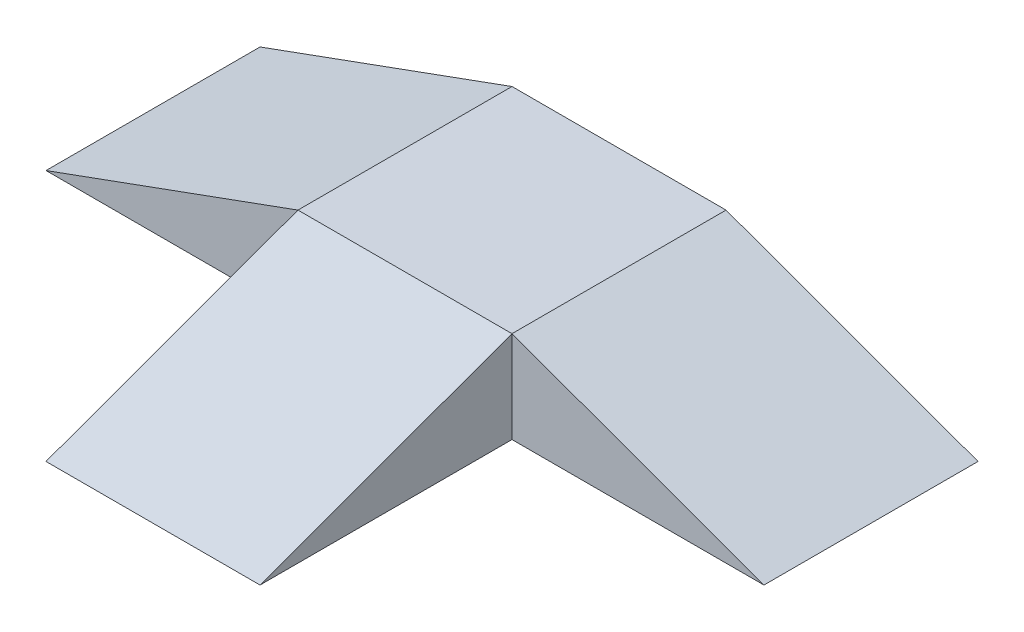
ISO-10303-21;
HEADER;
FILE_DESCRIPTION(('STEP AP214'),'2;1');
FILE_NAME('part.step','',(''),(''),'','','');
FILE_SCHEMA(('AUTOMOTIVE_DESIGN { 1 0 10303 214 1 1 1 1 }'));
ENDSEC;
DATA;
#1=APPLICATION_CONTEXT('core data for automotive mechanical design processes');
#2=APPLICATION_PROTOCOL_DEFINITION('international standard','automotive_design',2000,#1);
#3=PRODUCT_CONTEXT('',#1,'mechanical');
#4=PRODUCT('Part','Part','',(#3));
#5=PRODUCT_RELATED_PRODUCT_CATEGORY('part','',(#4));
#6=PRODUCT_DEFINITION_FORMATION('','',#4);
#7=PRODUCT_DEFINITION_CONTEXT('part definition',#1,'design');
#8=PRODUCT_DEFINITION('design','',#6,#7);
#9=PRODUCT_DEFINITION_SHAPE('','',#8);
#10=(LENGTH_UNIT() NAMED_UNIT(*) SI_UNIT(.MILLI.,.METRE.));
#11=(NAMED_UNIT(*) PLANE_ANGLE_UNIT() SI_UNIT($,.RADIAN.));
#12=(NAMED_UNIT(*) SI_UNIT($,.STERADIAN.) SOLID_ANGLE_UNIT());
#13=UNCERTAINTY_MEASURE_WITH_UNIT(LENGTH_MEASURE(1.E-05),#10,'distance_accuracy_value','');
#14=(GEOMETRIC_REPRESENTATION_CONTEXT(3) GLOBAL_UNCERTAINTY_ASSIGNED_CONTEXT((#13)) GLOBAL_UNIT_ASSIGNED_CONTEXT((#10,
#11,#12)) REPRESENTATION_CONTEXT('',''));
#15=CARTESIAN_POINT('',(0.,0.,0.));
#16=DIRECTION('',(0.,0.,1.));
#17=DIRECTION('',(1.,0.,0.));
#18=AXIS2_PLACEMENT_3D('',#15,#16,#17);
#19=CARTESIAN_POINT('',(175.,150.,-175.));
#20=DIRECTION('',(-1.,0.,0.));
#21=DIRECTION('',(0.,0.,1.));
#22=AXIS2_PLACEMENT_3D('',#19,#20,#21);
#23=PLANE('',#22);
#24=DIRECTION('',(0.,0.,-1.));
#25=VECTOR('',#24,1.);
#26=CARTESIAN_POINT('',(175.,0.,-175.));
#27=LINE('',#26,#25);
#28=CARTESIAN_POINT('',(175.,0.,587.));
#29=VERTEX_POINT('',#28);
#30=CARTESIAN_POINT('',(175.,0.,175.));
#31=VERTEX_POINT('',#30);
#32=EDGE_CURVE('E134',#29,#31,#27,.T.);
#33=ORIENTED_EDGE('',*,*,#32,.T.);
#34=DIRECTION('',(0.,1.,0.));
#35=VECTOR('',#34,1.);
#36=CARTESIAN_POINT('',(175.,150.,175.));
#37=LINE('',#36,#35);
#38=CARTESIAN_POINT('',(175.,150.,175.));
#39=VERTEX_POINT('',#38);
#40=EDGE_CURVE('E107',#31,#39,#37,.T.);
#41=ORIENTED_EDGE('',*,*,#40,.T.);
#42=DIRECTION('',(0.,-0.342109285519093,0.939660170892443));
#43=VECTOR('',#42,1.);
#44=CARTESIAN_POINT('',(175.,0.,587.));
#45=LINE('',#44,#43);
#46=EDGE_CURVE('E125',#39,#29,#45,.T.);
#47=ORIENTED_EDGE('',*,*,#46,.T.);
#48=EDGE_LOOP('',(#33,#41,#47));
#49=FACE_BOUND('',#48,.T.);
#50=ADVANCED_FACE('F37',(#49),#23,.F.);
#51=CARTESIAN_POINT('',(-175.,150.,-175.));
#52=DIRECTION('',(0.,0.,1.));
#53=DIRECTION('',(1.,0.,0.));
#54=AXIS2_PLACEMENT_3D('',#51,#52,#53);
#55=PLANE('',#54);
#56=DIRECTION('',(-1.,0.,0.));
#57=VECTOR('',#56,1.);
#58=CARTESIAN_POINT('',(-175.,0.,-175.));
#59=LINE('',#58,#57);
#60=CARTESIAN_POINT('',(587.,0.,-175.));
#61=VERTEX_POINT('',#60);
#62=CARTESIAN_POINT('',(-587.,0.,-175.));
#63=VERTEX_POINT('',#62);
#64=EDGE_CURVE('E98',#61,#63,#59,.T.);
#65=ORIENTED_EDGE('',*,*,#64,.T.);
#66=DIRECTION('',(0.939660170892443,0.342109285519093,0.));
#67=VECTOR('',#66,1.);
#68=CARTESIAN_POINT('',(-587.,0.,-175.));
#69=LINE('',#68,#67);
#70=CARTESIAN_POINT('',(-175.,150.,-175.));
#71=VERTEX_POINT('',#70);
#72=EDGE_CURVE('E101',#63,#71,#69,.T.);
#73=ORIENTED_EDGE('',*,*,#72,.T.);
#74=DIRECTION('',(-1.,0.,0.));
#75=VECTOR('',#74,1.);
#76=CARTESIAN_POINT('',(-175.,150.,-175.));
#77=LINE('',#76,#75);
#78=CARTESIAN_POINT('',(175.,150.,-175.));
#79=VERTEX_POINT('',#78);
#80=EDGE_CURVE('E136',#79,#71,#77,.T.);
#81=ORIENTED_EDGE('',*,*,#80,.F.);
#82=DIRECTION('',(0.939660170892443,-0.342109285519093,0.));
#83=VECTOR('',#82,1.);
#84=CARTESIAN_POINT('',(587.,0.,-175.));
#85=LINE('',#84,#83);
#86=EDGE_CURVE('E113',#79,#61,#85,.T.);
#87=ORIENTED_EDGE('',*,*,#86,.T.);
#88=EDGE_LOOP('',(#65,#73,#81,#87));
#89=FACE_BOUND('',#88,.T.);
#90=ADVANCED_FACE('F157',(#89),#55,.F.);
#91=CARTESIAN_POINT('',(-175.,150.,-175.));
#92=DIRECTION('',(1.,0.,0.));
#93=DIRECTION('',(0.,0.,-1.));
#94=AXIS2_PLACEMENT_3D('',#91,#92,#93);
#95=PLANE('',#94);
#96=DIRECTION('',(0.,-0.342109285519093,0.939660170892443));
#97=VECTOR('',#96,1.);
#98=CARTESIAN_POINT('',(-175.,0.,587.));
#99=LINE('',#98,#97);
#100=CARTESIAN_POINT('',(-175.,150.,175.));
#101=VERTEX_POINT('',#100);
#102=CARTESIAN_POINT('',(-175.,0.,587.));
#103=VERTEX_POINT('',#102);
#104=EDGE_CURVE('E126',#101,#103,#99,.T.);
#105=ORIENTED_EDGE('',*,*,#104,.F.);
#106=DIRECTION('',(0.,-1.,0.));
#107=VECTOR('',#106,1.);
#108=CARTESIAN_POINT('',(-175.,150.,175.));
#109=LINE('',#108,#107);
#110=CARTESIAN_POINT('',(-175.,0.,175.));
#111=VERTEX_POINT('',#110);
#112=EDGE_CURVE('E118',#101,#111,#109,.T.);
#113=ORIENTED_EDGE('',*,*,#112,.T.);
#114=DIRECTION('',(0.,0.,1.));
#115=VECTOR('',#114,1.);
#116=CARTESIAN_POINT('',(-175.,0.,-175.));
#117=LINE('',#116,#115);
#118=EDGE_CURVE('E40',#111,#103,#117,.T.);
#119=ORIENTED_EDGE('',*,*,#118,.T.);
#120=EDGE_LOOP('',(#105,#113,#119));
#121=FACE_BOUND('',#120,.T.);
#122=ADVANCED_FACE('F146',(#121),#95,.F.);
#123=CARTESIAN_POINT('',(0.,150.,0.));
#124=DIRECTION('',(0.,1.,0.));
#125=DIRECTION('',(0.,0.,1.));
#126=AXIS2_PLACEMENT_3D('',#123,#124,#125);
#127=PLANE('',#126);
#128=DIRECTION('',(0.,0.,-1.));
#129=VECTOR('',#128,1.);
#130=CARTESIAN_POINT('',(175.,150.,-175.));
#131=LINE('',#130,#129);
#132=EDGE_CURVE('E105',#39,#79,#131,.T.);
#133=ORIENTED_EDGE('',*,*,#132,.T.);
#134=ORIENTED_EDGE('',*,*,#80,.T.);
#135=DIRECTION('',(0.,0.,1.));
#136=VECTOR('',#135,1.);
#137=CARTESIAN_POINT('',(-175.,150.,-175.));
#138=LINE('',#137,#136);
#139=EDGE_CURVE('E45',#71,#101,#138,.T.);
#140=ORIENTED_EDGE('',*,*,#139,.T.);
#141=DIRECTION('',(1.,0.,0.));
#142=VECTOR('',#141,1.);
#143=CARTESIAN_POINT('',(-175.,150.,175.));
#144=LINE('',#143,#142);
#145=EDGE_CURVE('E11',#101,#39,#144,.T.);
#146=ORIENTED_EDGE('',*,*,#145,.T.);
#147=EDGE_LOOP('',(#133,#134,#140,#146));
#148=FACE_BOUND('',#147,.T.);
#149=ADVANCED_FACE('F152',(#148),#127,.T.);
#150=CARTESIAN_POINT('',(0.,0.,0.));
#151=DIRECTION('',(0.,1.,0.));
#152=DIRECTION('',(0.,0.,1.));
#153=AXIS2_PLACEMENT_3D('',#150,#151,#152);
#154=PLANE('',#153);
#155=ORIENTED_EDGE('',*,*,#32,.F.);
#156=DIRECTION('',(1.,0.,0.));
#157=VECTOR('',#156,1.);
#158=CARTESIAN_POINT('',(-175.,0.,587.));
#159=LINE('',#158,#157);
#160=EDGE_CURVE('E129',#103,#29,#159,.T.);
#161=ORIENTED_EDGE('',*,*,#160,.F.);
#162=ORIENTED_EDGE('',*,*,#118,.F.);
#163=DIRECTION('',(-1.,0.,0.));
#164=VECTOR('',#163,1.);
#165=CARTESIAN_POINT('',(-175.,0.,175.));
#166=LINE('',#165,#164);
#167=CARTESIAN_POINT('',(-587.,0.,175.));
#168=VERTEX_POINT('',#167);
#169=EDGE_CURVE('E53',#111,#168,#166,.T.);
#170=ORIENTED_EDGE('',*,*,#169,.T.);
#171=DIRECTION('',(0.,0.,-1.));
#172=VECTOR('',#171,1.);
#173=CARTESIAN_POINT('',(-587.,0.,175.));
#174=LINE('',#173,#172);
#175=EDGE_CURVE('E121',#168,#63,#174,.T.);
#176=ORIENTED_EDGE('',*,*,#175,.T.);
#177=ORIENTED_EDGE('',*,*,#64,.F.);
#178=DIRECTION('',(0.,0.,-1.));
#179=VECTOR('',#178,1.);
#180=CARTESIAN_POINT('',(587.,0.,175.));
#181=LINE('',#180,#179);
#182=CARTESIAN_POINT('',(587.,0.,175.));
#183=VERTEX_POINT('',#182);
#184=EDGE_CURVE('E93',#183,#61,#181,.T.);
#185=ORIENTED_EDGE('',*,*,#184,.F.);
#186=DIRECTION('',(-1.,0.,0.));
#187=VECTOR('',#186,1.);
#188=CARTESIAN_POINT('',(175.,0.,175.));
#189=LINE('',#188,#187);
#190=EDGE_CURVE('E95',#183,#31,#189,.T.);
#191=ORIENTED_EDGE('',*,*,#190,.T.);
#192=EDGE_LOOP('',(#155,#161,#162,#170,#176,#177,#185,#191));
#193=FACE_BOUND('',#192,.T.);
#194=ADVANCED_FACE('F94',(#193),#154,.F.);
#195=CARTESIAN_POINT('',(-175.,0.,587.));
#196=DIRECTION('',(0.,0.939660170892443,0.342109285519093));
#197=DIRECTION('',(0.,-0.342109285519093,0.939660170892443));
#198=AXIS2_PLACEMENT_3D('',#195,#196,#197);
#199=PLANE('',#198);
#200=ORIENTED_EDGE('',*,*,#46,.F.);
#201=ORIENTED_EDGE('',*,*,#145,.F.);
#202=ORIENTED_EDGE('',*,*,#104,.T.);
#203=ORIENTED_EDGE('',*,*,#160,.T.);
#204=EDGE_LOOP('',(#200,#201,#202,#203));
#205=FACE_BOUND('',#204,.T.);
#206=ADVANCED_FACE('F150',(#205),#199,.T.);
#207=CARTESIAN_POINT('',(-587.,0.,175.));
#208=DIRECTION('',(-0.342109285519093,0.939660170892443,0.));
#209=DIRECTION('',(-0.939660170892443,-0.342109285519093,0.));
#210=AXIS2_PLACEMENT_3D('',#207,#208,#209);
#211=PLANE('',#210);
#212=ORIENTED_EDGE('',*,*,#72,.F.);
#213=ORIENTED_EDGE('',*,*,#175,.F.);
#214=DIRECTION('',(0.939660170892443,0.342109285519093,0.));
#215=VECTOR('',#214,1.);
#216=CARTESIAN_POINT('',(-587.,0.,175.));
#217=LINE('',#216,#215);
#218=EDGE_CURVE('E115',#168,#101,#217,.T.);
#219=ORIENTED_EDGE('',*,*,#218,.T.);
#220=ORIENTED_EDGE('',*,*,#139,.F.);
#221=EDGE_LOOP('',(#212,#213,#219,#220));
#222=FACE_BOUND('',#221,.T.);
#223=ADVANCED_FACE('F156',(#222),#211,.T.);
#224=CARTESIAN_POINT('',(0.,0.,175.));
#225=DIRECTION('',(0.,0.,-1.));
#226=DIRECTION('',(-1.,0.,0.));
#227=AXIS2_PLACEMENT_3D('',#224,#225,#226);
#228=PLANE('',#227);
#229=ORIENTED_EDGE('',*,*,#218,.F.);
#230=ORIENTED_EDGE('',*,*,#169,.F.);
#231=ORIENTED_EDGE('',*,*,#112,.F.);
#232=EDGE_LOOP('',(#229,#230,#231));
#233=FACE_BOUND('',#232,.T.);
#234=ADVANCED_FACE('F174',(#233),#228,.F.);
#235=CARTESIAN_POINT('',(587.,0.,175.));
#236=DIRECTION('',(0.342109285519093,0.939660170892443,0.));
#237=DIRECTION('',(-0.939660170892443,0.342109285519093,0.));
#238=AXIS2_PLACEMENT_3D('',#235,#236,#237);
#239=PLANE('',#238);
#240=ORIENTED_EDGE('',*,*,#86,.F.);
#241=ORIENTED_EDGE('',*,*,#132,.F.);
#242=DIRECTION('',(0.939660170892443,-0.342109285519093,0.));
#243=VECTOR('',#242,1.);
#244=CARTESIAN_POINT('',(587.,0.,175.));
#245=LINE('',#244,#243);
#246=EDGE_CURVE('E61',#39,#183,#245,.T.);
#247=ORIENTED_EDGE('',*,*,#246,.T.);
#248=ORIENTED_EDGE('',*,*,#184,.T.);
#249=EDGE_LOOP('',(#240,#241,#247,#248));
#250=FACE_BOUND('',#249,.T.);
#251=ADVANCED_FACE('F103',(#250),#239,.T.);
#252=CARTESIAN_POINT('',(0.,0.,175.));
#253=DIRECTION('',(0.,0.,1.));
#254=DIRECTION('',(1.,0.,0.));
#255=AXIS2_PLACEMENT_3D('',#252,#253,#254);
#256=PLANE('',#255);
#257=ORIENTED_EDGE('',*,*,#40,.F.);
#258=ORIENTED_EDGE('',*,*,#190,.F.);
#259=ORIENTED_EDGE('',*,*,#246,.F.);
#260=EDGE_LOOP('',(#257,#258,#259));
#261=FACE_BOUND('',#260,.T.);
#262=ADVANCED_FACE('F109',(#261),#256,.T.);
#263=CLOSED_SHELL('',(#50,#90,#122,#149,#194,#206,#223,#234,#251,#262));
#264=MANIFOLD_SOLID_BREP('B2',#263);
#265=ADVANCED_BREP_SHAPE_REPRESENTATION('',(#18,#264),#14);
#266=SHAPE_DEFINITION_REPRESENTATION(#9,#265);
ENDSEC;
END-ISO-10303-21;
